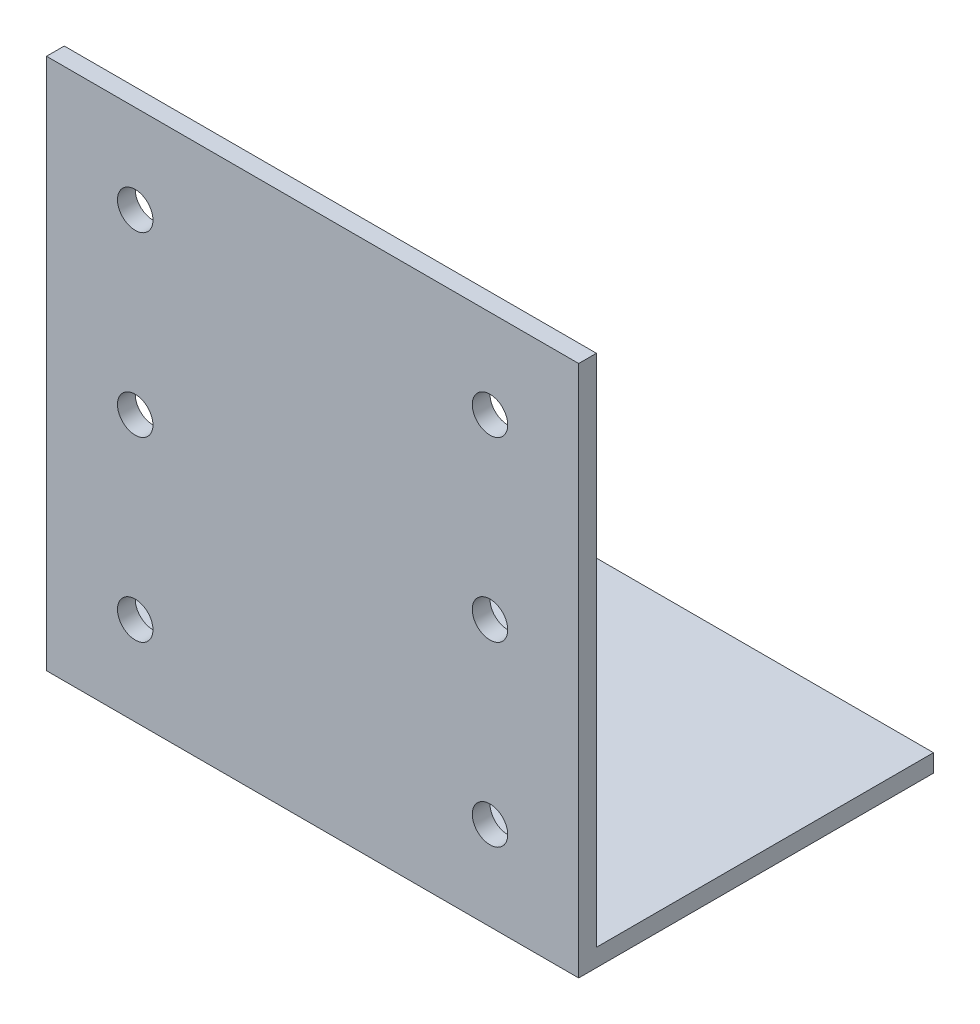
ISO-10303-21;
HEADER;
FILE_DESCRIPTION(('STEP AP214'),'2;1');
FILE_NAME('part.step','',(''),(''),'','','');
FILE_SCHEMA(('AUTOMOTIVE_DESIGN { 1 0 10303 214 1 1 1 1 }'));
ENDSEC;
DATA;
#1=APPLICATION_CONTEXT('core data for automotive mechanical design processes');
#2=APPLICATION_PROTOCOL_DEFINITION('international standard','automotive_design',2000,#1);
#3=PRODUCT_CONTEXT('',#1,'mechanical');
#4=PRODUCT('Part','Part','',(#3));
#5=PRODUCT_RELATED_PRODUCT_CATEGORY('part','',(#4));
#6=PRODUCT_DEFINITION_FORMATION('','',#4);
#7=PRODUCT_DEFINITION_CONTEXT('part definition',#1,'design');
#8=PRODUCT_DEFINITION('design','',#6,#7);
#9=PRODUCT_DEFINITION_SHAPE('','',#8);
#10=(LENGTH_UNIT() NAMED_UNIT(*) SI_UNIT(.MILLI.,.METRE.));
#11=(NAMED_UNIT(*) PLANE_ANGLE_UNIT() SI_UNIT($,.RADIAN.));
#12=(NAMED_UNIT(*) SI_UNIT($,.STERADIAN.) SOLID_ANGLE_UNIT());
#13=UNCERTAINTY_MEASURE_WITH_UNIT(LENGTH_MEASURE(1.E-05),#10,'distance_accuracy_value','');
#14=(GEOMETRIC_REPRESENTATION_CONTEXT(3) GLOBAL_UNCERTAINTY_ASSIGNED_CONTEXT((#13)) GLOBAL_UNIT_ASSIGNED_CONTEXT((#10,
#11,#12)) REPRESENTATION_CONTEXT('',''));
#15=CARTESIAN_POINT('',(0.,0.,0.));
#16=DIRECTION('',(0.,0.,1.));
#17=DIRECTION('',(1.,0.,0.));
#18=AXIS2_PLACEMENT_3D('',#15,#16,#17);
#19=CARTESIAN_POINT('',(60.,0.,0.));
#20=DIRECTION('',(0.,1.,0.));
#21=DIRECTION('',(0.,0.,1.));
#22=AXIS2_PLACEMENT_3D('',#19,#20,#21);
#23=PLANE('',#22);
#24=DIRECTION('',(0.,0.,-1.));
#25=VECTOR('',#24,1.);
#26=CARTESIAN_POINT('',(0.,0.,0.));
#27=LINE('',#26,#25);
#28=CARTESIAN_POINT('',(0.,0.,0.));
#29=VERTEX_POINT('',#28);
#30=CARTESIAN_POINT('',(0.,0.,-40.));
#31=VERTEX_POINT('',#30);
#32=EDGE_CURVE('E122',#29,#31,#27,.T.);
#33=ORIENTED_EDGE('',*,*,#32,.T.);
#34=DIRECTION('',(-1.,0.,0.));
#35=VECTOR('',#34,1.);
#36=CARTESIAN_POINT('',(60.,0.,-40.));
#37=LINE('',#36,#35);
#38=CARTESIAN_POINT('',(60.,0.,-40.));
#39=VERTEX_POINT('',#38);
#40=EDGE_CURVE('E11',#39,#31,#37,.T.);
#41=ORIENTED_EDGE('',*,*,#40,.F.);
#42=DIRECTION('',(0.,0.,-1.));
#43=VECTOR('',#42,1.);
#44=CARTESIAN_POINT('',(60.,0.,0.));
#45=LINE('',#44,#43);
#46=CARTESIAN_POINT('',(60.,0.,0.));
#47=VERTEX_POINT('',#46);
#48=EDGE_CURVE('E87',#47,#39,#45,.T.);
#49=ORIENTED_EDGE('',*,*,#48,.F.);
#50=DIRECTION('',(-1.,0.,0.));
#51=VECTOR('',#50,1.);
#52=CARTESIAN_POINT('',(60.,0.,0.));
#53=LINE('',#52,#51);
#54=EDGE_CURVE('E118',#47,#29,#53,.T.);
#55=ORIENTED_EDGE('',*,*,#54,.T.);
#56=EDGE_LOOP('',(#33,#41,#49,#55));
#57=FACE_BOUND('',#56,.T.);
#58=ADVANCED_FACE('F38',(#57),#23,.F.);
#59=CARTESIAN_POINT('',(60.,2.,-40.));
#60=DIRECTION('',(0.,0.,-1.));
#61=DIRECTION('',(-1.,0.,0.));
#62=AXIS2_PLACEMENT_3D('',#59,#60,#61);
#63=PLANE('',#62);
#64=DIRECTION('',(0.,-1.,0.));
#65=VECTOR('',#64,1.);
#66=CARTESIAN_POINT('',(0.,2.,-40.));
#67=LINE('',#66,#65);
#68=CARTESIAN_POINT('',(0.,2.,-40.));
#69=VERTEX_POINT('',#68);
#70=EDGE_CURVE('E125',#69,#31,#67,.T.);
#71=ORIENTED_EDGE('',*,*,#70,.F.);
#72=DIRECTION('',(-1.,0.,0.));
#73=VECTOR('',#72,1.);
#74=CARTESIAN_POINT('',(60.,2.,-40.));
#75=LINE('',#74,#73);
#76=CARTESIAN_POINT('',(60.,2.,-40.));
#77=VERTEX_POINT('',#76);
#78=EDGE_CURVE('E47',#77,#69,#75,.T.);
#79=ORIENTED_EDGE('',*,*,#78,.F.);
#80=DIRECTION('',(0.,-1.,0.));
#81=VECTOR('',#80,1.);
#82=CARTESIAN_POINT('',(60.,2.,-40.));
#83=LINE('',#82,#81);
#84=EDGE_CURVE('E214',#77,#39,#83,.T.);
#85=ORIENTED_EDGE('',*,*,#84,.T.);
#86=ORIENTED_EDGE('',*,*,#40,.T.);
#87=EDGE_LOOP('',(#71,#79,#85,#86));
#88=FACE_BOUND('',#87,.T.);
#89=ADVANCED_FACE('F146',(#88),#63,.T.);
#90=CARTESIAN_POINT('',(60.,2.,0.));
#91=DIRECTION('',(0.,1.,0.));
#92=DIRECTION('',(0.,0.,1.));
#93=AXIS2_PLACEMENT_3D('',#90,#91,#92);
#94=PLANE('',#93);
#95=DIRECTION('',(0.,0.,-1.));
#96=VECTOR('',#95,1.);
#97=CARTESIAN_POINT('',(0.,2.,0.));
#98=LINE('',#97,#96);
#99=CARTESIAN_POINT('',(0.,2.,-2.));
#100=VERTEX_POINT('',#99);
#101=EDGE_CURVE('E129',#100,#69,#98,.T.);
#102=ORIENTED_EDGE('',*,*,#101,.F.);
#103=DIRECTION('',(-1.,0.,0.));
#104=VECTOR('',#103,1.);
#105=CARTESIAN_POINT('',(60.,2.,-2.));
#106=LINE('',#105,#104);
#107=CARTESIAN_POINT('',(60.,2.,-2.));
#108=VERTEX_POINT('',#107);
#109=EDGE_CURVE('E108',#108,#100,#106,.T.);
#110=ORIENTED_EDGE('',*,*,#109,.F.);
#111=DIRECTION('',(0.,0.,-1.));
#112=VECTOR('',#111,1.);
#113=CARTESIAN_POINT('',(60.,2.,0.));
#114=LINE('',#113,#112);
#115=EDGE_CURVE('E114',#108,#77,#114,.T.);
#116=ORIENTED_EDGE('',*,*,#115,.T.);
#117=ORIENTED_EDGE('',*,*,#78,.T.);
#118=EDGE_LOOP('',(#102,#110,#116,#117));
#119=FACE_BOUND('',#118,.T.);
#120=ADVANCED_FACE('F143',(#119),#94,.T.);
#121=CARTESIAN_POINT('',(60.,0.,-2.));
#122=DIRECTION('',(0.,0.,-1.));
#123=DIRECTION('',(-1.,0.,0.));
#124=AXIS2_PLACEMENT_3D('',#121,#122,#123);
#125=PLANE('',#124);
#126=CARTESIAN_POINT('',(10.0000000000011,30.,-2.));
#127=DIRECTION('',(0.,0.,-1.));
#128=DIRECTION('',(-1.,0.,0.));
#129=AXIS2_PLACEMENT_3D('',#126,#127,#128);
#130=CIRCLE('',#129,2.);
#131=CARTESIAN_POINT('',(8.00000000000106,30.,-2.));
#132=VERTEX_POINT('',#131);
#133=EDGE_CURVE('E126',#132,#132,#130,.T.);
#134=ORIENTED_EDGE('',*,*,#133,.F.);
#135=EDGE_LOOP('',(#134));
#136=FACE_BOUND('',#135,.T.);
#137=CARTESIAN_POINT('',(50.0000000000021,10.,-2.));
#138=DIRECTION('',(0.,0.,-1.));
#139=DIRECTION('',(-1.,0.,0.));
#140=AXIS2_PLACEMENT_3D('',#137,#138,#139);
#141=CIRCLE('',#140,2.);
#142=CARTESIAN_POINT('',(48.0000000000021,10.,-2.));
#143=VERTEX_POINT('',#142);
#144=EDGE_CURVE('E183',#143,#143,#141,.T.);
#145=ORIENTED_EDGE('',*,*,#144,.F.);
#146=EDGE_LOOP('',(#145));
#147=FACE_BOUND('',#146,.T.);
#148=CARTESIAN_POINT('',(50.0000000000014,30.,-2.));
#149=DIRECTION('',(0.,0.,-1.));
#150=DIRECTION('',(-1.,0.,0.));
#151=AXIS2_PLACEMENT_3D('',#148,#149,#150);
#152=CIRCLE('',#151,2.);
#153=CARTESIAN_POINT('',(48.0000000000014,30.,-2.));
#154=VERTEX_POINT('',#153);
#155=EDGE_CURVE('E187',#154,#154,#152,.T.);
#156=ORIENTED_EDGE('',*,*,#155,.F.);
#157=EDGE_LOOP('',(#156));
#158=FACE_BOUND('',#157,.T.);
#159=CARTESIAN_POINT('',(50.0000000000006,50.,-2.));
#160=DIRECTION('',(0.,0.,-1.));
#161=DIRECTION('',(-1.,0.,0.));
#162=AXIS2_PLACEMENT_3D('',#159,#160,#161);
#163=CIRCLE('',#162,2.);
#164=CARTESIAN_POINT('',(48.0000000000006,50.,-2.));
#165=VERTEX_POINT('',#164);
#166=EDGE_CURVE('E191',#165,#165,#163,.T.);
#167=ORIENTED_EDGE('',*,*,#166,.F.);
#168=EDGE_LOOP('',(#167));
#169=FACE_BOUND('',#168,.T.);
#170=CARTESIAN_POINT('',(10.0000000000016,10.,-2.));
#171=DIRECTION('',(0.,0.,-1.));
#172=DIRECTION('',(-1.,0.,0.));
#173=AXIS2_PLACEMENT_3D('',#170,#171,#172);
#174=CIRCLE('',#173,2.);
#175=CARTESIAN_POINT('',(8.00000000000155,10.,-2.));
#176=VERTEX_POINT('',#175);
#177=EDGE_CURVE('E195',#176,#176,#174,.T.);
#178=ORIENTED_EDGE('',*,*,#177,.F.);
#179=EDGE_LOOP('',(#178));
#180=FACE_BOUND('',#179,.T.);
#181=CARTESIAN_POINT('',(10.0000000000006,50.,-2.));
#182=DIRECTION('',(0.,0.,-1.));
#183=DIRECTION('',(-1.,0.,0.));
#184=AXIS2_PLACEMENT_3D('',#181,#182,#183);
#185=CIRCLE('',#184,2.);
#186=CARTESIAN_POINT('',(8.00000000000057,50.,-2.));
#187=VERTEX_POINT('',#186);
#188=EDGE_CURVE('E198',#187,#187,#185,.T.);
#189=ORIENTED_EDGE('',*,*,#188,.F.);
#190=EDGE_LOOP('',(#189));
#191=FACE_BOUND('',#190,.T.);
#192=DIRECTION('',(0.,1.,0.));
#193=VECTOR('',#192,1.);
#194=CARTESIAN_POINT('',(0.,0.,-2.));
#195=LINE('',#194,#193);
#196=CARTESIAN_POINT('',(0.,60.,-2.));
#197=VERTEX_POINT('',#196);
#198=EDGE_CURVE('E103',#197,#100,#195,.F.);
#199=ORIENTED_EDGE('',*,*,#198,.F.);
#200=DIRECTION('',(-1.,0.,0.));
#201=VECTOR('',#200,1.);
#202=CARTESIAN_POINT('',(60.,60.,-2.));
#203=LINE('',#202,#201);
#204=CARTESIAN_POINT('',(60.,60.,-2.));
#205=VERTEX_POINT('',#204);
#206=EDGE_CURVE('E98',#205,#197,#203,.T.);
#207=ORIENTED_EDGE('',*,*,#206,.F.);
#208=DIRECTION('',(0.,1.,0.));
#209=VECTOR('',#208,1.);
#210=CARTESIAN_POINT('',(60.,0.,-2.));
#211=LINE('',#210,#209);
#212=EDGE_CURVE('E101',#205,#108,#211,.F.);
#213=ORIENTED_EDGE('',*,*,#212,.T.);
#214=ORIENTED_EDGE('',*,*,#109,.T.);
#215=EDGE_LOOP('',(#199,#207,#213,#214));
#216=FACE_BOUND('',#215,.T.);
#217=ADVANCED_FACE('F100',(#136,#147,#158,#169,#180,#191,#216),#125,.T.);
#218=CARTESIAN_POINT('',(60.,60.,0.));
#219=DIRECTION('',(0.,1.,0.));
#220=DIRECTION('',(0.,0.,1.));
#221=AXIS2_PLACEMENT_3D('',#218,#219,#220);
#222=PLANE('',#221);
#223=DIRECTION('',(0.,0.,-1.));
#224=VECTOR('',#223,1.);
#225=CARTESIAN_POINT('',(0.,60.,0.));
#226=LINE('',#225,#224);
#227=CARTESIAN_POINT('',(0.,60.,0.));
#228=VERTEX_POINT('',#227);
#229=EDGE_CURVE('E133',#228,#197,#226,.T.);
#230=ORIENTED_EDGE('',*,*,#229,.F.);
#231=DIRECTION('',(-1.,0.,0.));
#232=VECTOR('',#231,1.);
#233=CARTESIAN_POINT('',(60.,60.,0.));
#234=LINE('',#233,#232);
#235=CARTESIAN_POINT('',(60.,60.,0.));
#236=VERTEX_POINT('',#235);
#237=EDGE_CURVE('E76',#236,#228,#234,.T.);
#238=ORIENTED_EDGE('',*,*,#237,.F.);
#239=DIRECTION('',(0.,0.,-1.));
#240=VECTOR('',#239,1.);
#241=CARTESIAN_POINT('',(60.,60.,0.));
#242=LINE('',#241,#240);
#243=EDGE_CURVE('E112',#236,#205,#242,.T.);
#244=ORIENTED_EDGE('',*,*,#243,.T.);
#245=ORIENTED_EDGE('',*,*,#206,.T.);
#246=EDGE_LOOP('',(#230,#238,#244,#245));
#247=FACE_BOUND('',#246,.T.);
#248=ADVANCED_FACE('F116',(#247),#222,.T.);
#249=CARTESIAN_POINT('',(60.,0.,0.));
#250=DIRECTION('',(0.,0.,-1.));
#251=DIRECTION('',(-1.,0.,0.));
#252=AXIS2_PLACEMENT_3D('',#249,#250,#251);
#253=PLANE('',#252);
#254=CARTESIAN_POINT('',(10.0000000000011,30.,0.));
#255=DIRECTION('',(0.,0.,1.));
#256=DIRECTION('',(1.,0.,0.));
#257=AXIS2_PLACEMENT_3D('',#254,#255,#256);
#258=CIRCLE('',#257,2.);
#259=CARTESIAN_POINT('',(12.0000000000011,30.,0.));
#260=VERTEX_POINT('',#259);
#261=EDGE_CURVE('E223',#260,#260,#258,.T.);
#262=ORIENTED_EDGE('',*,*,#261,.F.);
#263=EDGE_LOOP('',(#262));
#264=FACE_BOUND('',#263,.T.);
#265=CARTESIAN_POINT('',(50.0000000000021,10.,0.));
#266=DIRECTION('',(0.,0.,1.));
#267=DIRECTION('',(1.,0.,0.));
#268=AXIS2_PLACEMENT_3D('',#265,#266,#267);
#269=CIRCLE('',#268,2.);
#270=CARTESIAN_POINT('',(52.0000000000021,10.,0.));
#271=VERTEX_POINT('',#270);
#272=EDGE_CURVE('E224',#271,#271,#269,.T.);
#273=ORIENTED_EDGE('',*,*,#272,.F.);
#274=EDGE_LOOP('',(#273));
#275=FACE_BOUND('',#274,.T.);
#276=CARTESIAN_POINT('',(50.0000000000014,30.,0.));
#277=DIRECTION('',(0.,0.,1.));
#278=DIRECTION('',(1.,0.,0.));
#279=AXIS2_PLACEMENT_3D('',#276,#277,#278);
#280=CIRCLE('',#279,2.);
#281=CARTESIAN_POINT('',(52.0000000000013,30.,0.));
#282=VERTEX_POINT('',#281);
#283=EDGE_CURVE('E228',#282,#282,#280,.T.);
#284=ORIENTED_EDGE('',*,*,#283,.F.);
#285=EDGE_LOOP('',(#284));
#286=FACE_BOUND('',#285,.T.);
#287=CARTESIAN_POINT('',(50.0000000000006,50.,0.));
#288=DIRECTION('',(0.,0.,1.));
#289=DIRECTION('',(1.,0.,0.));
#290=AXIS2_PLACEMENT_3D('',#287,#288,#289);
#291=CIRCLE('',#290,2.);
#292=CARTESIAN_POINT('',(52.0000000000006,50.,0.));
#293=VERTEX_POINT('',#292);
#294=EDGE_CURVE('E204',#293,#293,#291,.T.);
#295=ORIENTED_EDGE('',*,*,#294,.F.);
#296=EDGE_LOOP('',(#295));
#297=FACE_BOUND('',#296,.T.);
#298=CARTESIAN_POINT('',(10.0000000000016,10.,0.));
#299=DIRECTION('',(0.,0.,1.));
#300=DIRECTION('',(1.,0.,0.));
#301=AXIS2_PLACEMENT_3D('',#298,#299,#300);
#302=CIRCLE('',#301,2.);
#303=CARTESIAN_POINT('',(12.0000000000016,10.,0.));
#304=VERTEX_POINT('',#303);
#305=EDGE_CURVE('E225',#304,#304,#302,.T.);
#306=ORIENTED_EDGE('',*,*,#305,.F.);
#307=EDGE_LOOP('',(#306));
#308=FACE_BOUND('',#307,.T.);
#309=CARTESIAN_POINT('',(10.0000000000006,50.,0.));
#310=DIRECTION('',(0.,0.,1.));
#311=DIRECTION('',(1.,0.,0.));
#312=AXIS2_PLACEMENT_3D('',#309,#310,#311);
#313=CIRCLE('',#312,2.);
#314=CARTESIAN_POINT('',(12.0000000000006,50.,0.));
#315=VERTEX_POINT('',#314);
#316=EDGE_CURVE('E200',#315,#315,#313,.T.);
#317=ORIENTED_EDGE('',*,*,#316,.F.);
#318=EDGE_LOOP('',(#317));
#319=FACE_BOUND('',#318,.T.);
#320=DIRECTION('',(0.,-1.,0.));
#321=VECTOR('',#320,1.);
#322=CARTESIAN_POINT('',(0.,0.,0.));
#323=LINE('',#322,#321);
#324=EDGE_CURVE('E79',#228,#29,#323,.T.);
#325=ORIENTED_EDGE('',*,*,#324,.T.);
#326=ORIENTED_EDGE('',*,*,#54,.F.);
#327=DIRECTION('',(0.,-1.,0.));
#328=VECTOR('',#327,1.);
#329=CARTESIAN_POINT('',(60.,0.,0.));
#330=LINE('',#329,#328);
#331=EDGE_CURVE('E55',#236,#47,#330,.T.);
#332=ORIENTED_EDGE('',*,*,#331,.F.);
#333=ORIENTED_EDGE('',*,*,#237,.T.);
#334=EDGE_LOOP('',(#325,#326,#332,#333));
#335=FACE_BOUND('',#334,.T.);
#336=ADVANCED_FACE('F151',(#264,#275,#286,#297,#308,#319,#335),#253,.F.);
#337=CARTESIAN_POINT('',(60.,0.,0.));
#338=DIRECTION('',(-1.,0.,0.));
#339=DIRECTION('',(0.,0.,1.));
#340=AXIS2_PLACEMENT_3D('',#337,#338,#339);
#341=PLANE('',#340);
#342=ORIENTED_EDGE('',*,*,#48,.T.);
#343=ORIENTED_EDGE('',*,*,#84,.F.);
#344=ORIENTED_EDGE('',*,*,#115,.F.);
#345=ORIENTED_EDGE('',*,*,#212,.F.);
#346=ORIENTED_EDGE('',*,*,#243,.F.);
#347=ORIENTED_EDGE('',*,*,#331,.T.);
#348=EDGE_LOOP('',(#342,#343,#344,#345,#346,#347));
#349=FACE_BOUND('',#348,.T.);
#350=ADVANCED_FACE('F111',(#349),#341,.F.);
#351=CARTESIAN_POINT('',(0.,0.,0.));
#352=DIRECTION('',(-1.,0.,0.));
#353=DIRECTION('',(0.,0.,1.));
#354=AXIS2_PLACEMENT_3D('',#351,#352,#353);
#355=PLANE('',#354);
#356=ORIENTED_EDGE('',*,*,#32,.F.);
#357=ORIENTED_EDGE('',*,*,#324,.F.);
#358=ORIENTED_EDGE('',*,*,#229,.T.);
#359=ORIENTED_EDGE('',*,*,#198,.T.);
#360=ORIENTED_EDGE('',*,*,#101,.T.);
#361=ORIENTED_EDGE('',*,*,#70,.T.);
#362=EDGE_LOOP('',(#356,#357,#358,#359,#360,#361));
#363=FACE_BOUND('',#362,.T.);
#364=ADVANCED_FACE('F149',(#363),#355,.T.);
#365=CARTESIAN_POINT('',(10.0000000000006,50.,-40.));
#366=DIRECTION('',(0.,0.,1.));
#367=DIRECTION('',(1.,0.,0.));
#368=AXIS2_PLACEMENT_3D('',#365,#366,#367);
#369=CYLINDRICAL_SURFACE('',#368,2.);
#370=ORIENTED_EDGE('',*,*,#188,.T.);
#371=EDGE_LOOP('',(#370));
#372=FACE_BOUND('',#371,.T.);
#373=ORIENTED_EDGE('',*,*,#316,.T.);
#374=EDGE_LOOP('',(#373));
#375=FACE_BOUND('',#374,.T.);
#376=ADVANCED_FACE('F246',(#372,#375),#369,.F.);
#377=CARTESIAN_POINT('',(10.0000000000016,10.,-40.));
#378=DIRECTION('',(0.,0.,1.));
#379=DIRECTION('',(1.,0.,0.));
#380=AXIS2_PLACEMENT_3D('',#377,#378,#379);
#381=CYLINDRICAL_SURFACE('',#380,2.);
#382=ORIENTED_EDGE('',*,*,#177,.T.);
#383=EDGE_LOOP('',(#382));
#384=FACE_BOUND('',#383,.T.);
#385=ORIENTED_EDGE('',*,*,#305,.T.);
#386=EDGE_LOOP('',(#385));
#387=FACE_BOUND('',#386,.T.);
#388=ADVANCED_FACE('F248',(#384,#387),#381,.F.);
#389=CARTESIAN_POINT('',(50.0000000000006,50.,-40.));
#390=DIRECTION('',(0.,0.,1.));
#391=DIRECTION('',(1.,0.,0.));
#392=AXIS2_PLACEMENT_3D('',#389,#390,#391);
#393=CYLINDRICAL_SURFACE('',#392,2.);
#394=ORIENTED_EDGE('',*,*,#166,.T.);
#395=EDGE_LOOP('',(#394));
#396=FACE_BOUND('',#395,.T.);
#397=ORIENTED_EDGE('',*,*,#294,.T.);
#398=EDGE_LOOP('',(#397));
#399=FACE_BOUND('',#398,.T.);
#400=ADVANCED_FACE('F254',(#396,#399),#393,.F.);
#401=CARTESIAN_POINT('',(50.0000000000014,30.,-40.));
#402=DIRECTION('',(0.,0.,1.));
#403=DIRECTION('',(1.,0.,0.));
#404=AXIS2_PLACEMENT_3D('',#401,#402,#403);
#405=CYLINDRICAL_SURFACE('',#404,2.);
#406=ORIENTED_EDGE('',*,*,#155,.T.);
#407=EDGE_LOOP('',(#406));
#408=FACE_BOUND('',#407,.T.);
#409=ORIENTED_EDGE('',*,*,#283,.T.);
#410=EDGE_LOOP('',(#409));
#411=FACE_BOUND('',#410,.T.);
#412=ADVANCED_FACE('F237',(#408,#411),#405,.F.);
#413=CARTESIAN_POINT('',(50.0000000000021,10.,-40.));
#414=DIRECTION('',(0.,0.,1.));
#415=DIRECTION('',(1.,0.,0.));
#416=AXIS2_PLACEMENT_3D('',#413,#414,#415);
#417=CYLINDRICAL_SURFACE('',#416,2.);
#418=ORIENTED_EDGE('',*,*,#144,.T.);
#419=EDGE_LOOP('',(#418));
#420=FACE_BOUND('',#419,.T.);
#421=ORIENTED_EDGE('',*,*,#272,.T.);
#422=EDGE_LOOP('',(#421));
#423=FACE_BOUND('',#422,.T.);
#424=ADVANCED_FACE('F220',(#420,#423),#417,.F.);
#425=CARTESIAN_POINT('',(10.0000000000011,30.,-40.));
#426=DIRECTION('',(0.,0.,1.));
#427=DIRECTION('',(1.,0.,0.));
#428=AXIS2_PLACEMENT_3D('',#425,#426,#427);
#429=CYLINDRICAL_SURFACE('',#428,2.);
#430=ORIENTED_EDGE('',*,*,#133,.T.);
#431=EDGE_LOOP('',(#430));
#432=FACE_BOUND('',#431,.T.);
#433=ORIENTED_EDGE('',*,*,#261,.T.);
#434=EDGE_LOOP('',(#433));
#435=FACE_BOUND('',#434,.T.);
#436=ADVANCED_FACE('F217',(#432,#435),#429,.F.);
#437=CLOSED_SHELL('',(#58,#89,#120,#217,#248,#336,#350,#364,#376,#388,#400,#412,#424,#436));
#438=MANIFOLD_SOLID_BREP('B2',#437);
#439=ADVANCED_BREP_SHAPE_REPRESENTATION('',(#18,#438),#14);
#440=SHAPE_DEFINITION_REPRESENTATION(#9,#439);
ENDSEC;
END-ISO-10303-21;
